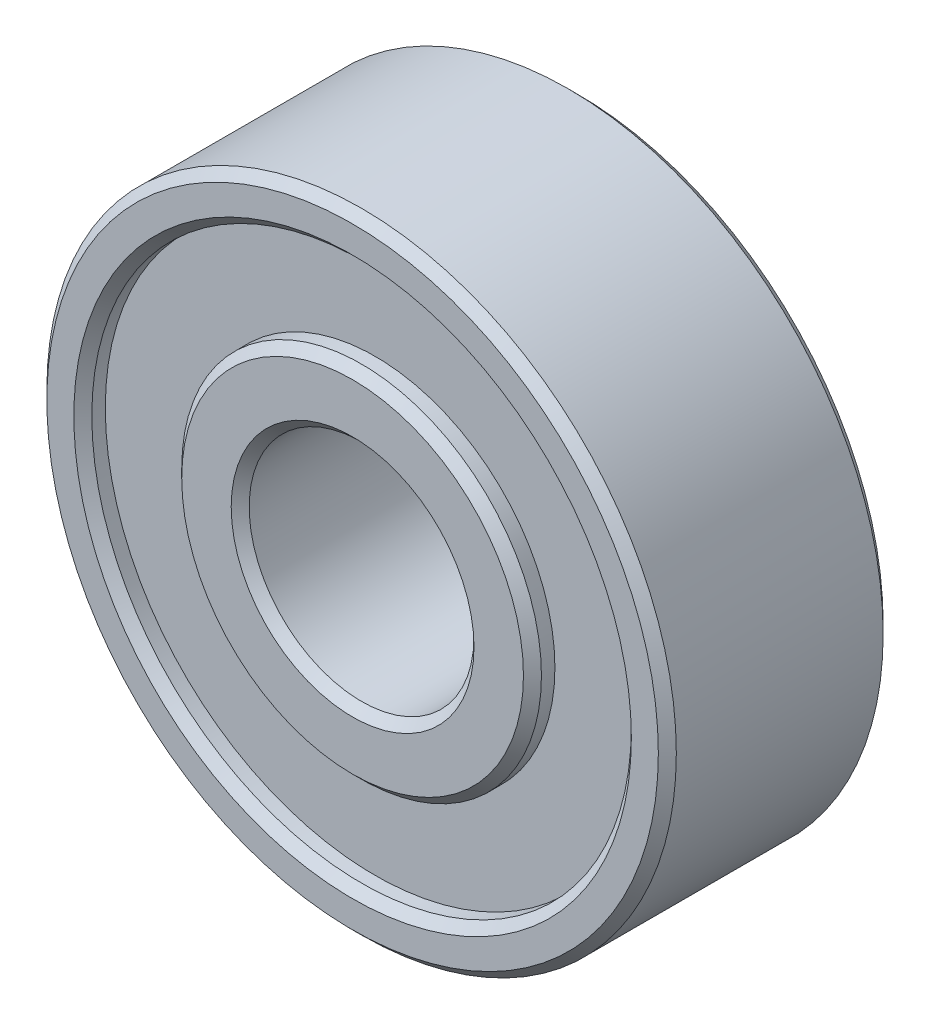
ISO-10303-21;
HEADER;
FILE_DESCRIPTION(('STEP AP214'),'2;1');
FILE_NAME('part.step','',(''),(''),'','','');
FILE_SCHEMA(('AUTOMOTIVE_DESIGN { 1 0 10303 214 1 1 1 1 }'));
ENDSEC;
DATA;
#1=APPLICATION_CONTEXT('core data for automotive mechanical design processes');
#2=APPLICATION_PROTOCOL_DEFINITION('international standard','automotive_design',2000,#1);
#3=PRODUCT_CONTEXT('',#1,'mechanical');
#4=PRODUCT('Part','Part','',(#3));
#5=PRODUCT_RELATED_PRODUCT_CATEGORY('part','',(#4));
#6=PRODUCT_DEFINITION_FORMATION('','',#4);
#7=PRODUCT_DEFINITION_CONTEXT('part definition',#1,'design');
#8=PRODUCT_DEFINITION('design','',#6,#7);
#9=PRODUCT_DEFINITION_SHAPE('','',#8);
#10=(LENGTH_UNIT() NAMED_UNIT(*) SI_UNIT(.MILLI.,.METRE.));
#11=(NAMED_UNIT(*) PLANE_ANGLE_UNIT() SI_UNIT($,.RADIAN.));
#12=(NAMED_UNIT(*) SI_UNIT($,.STERADIAN.) SOLID_ANGLE_UNIT());
#13=UNCERTAINTY_MEASURE_WITH_UNIT(LENGTH_MEASURE(1.E-05),#10,'distance_accuracy_value','');
#14=(GEOMETRIC_REPRESENTATION_CONTEXT(3) GLOBAL_UNCERTAINTY_ASSIGNED_CONTEXT((#13)) GLOBAL_UNIT_ASSIGNED_CONTEXT((#10,
#11,#12)) REPRESENTATION_CONTEXT('',''));
#15=CARTESIAN_POINT('',(0.,0.,0.));
#16=DIRECTION('',(0.,0.,1.));
#17=DIRECTION('',(1.,0.,0.));
#18=AXIS2_PLACEMENT_3D('',#15,#16,#17);
#19=CARTESIAN_POINT('',(0.,0.,0.));
#20=DIRECTION('',(0.,0.,1.));
#21=DIRECTION('',(1.,0.,0.));
#22=AXIS2_PLACEMENT_3D('',#19,#20,#21);
#23=PLANE('',#22);
#24=CARTESIAN_POINT('',(0.,0.,0.));
#25=DIRECTION('',(0.,0.,1.));
#26=DIRECTION('',(1.,0.,0.));
#27=AXIS2_PLACEMENT_3D('',#24,#25,#26);
#28=CIRCLE('',#27,3.8);
#29=CARTESIAN_POINT('',(3.8,0.,0.));
#30=VERTEX_POINT('',#29);
#31=EDGE_CURVE('E73',#30,#30,#28,.F.);
#32=ORIENTED_EDGE('',*,*,#31,.T.);
#33=EDGE_LOOP('',(#32));
#34=FACE_BOUND('',#33,.T.);
#35=CARTESIAN_POINT('',(0.,0.,0.));
#36=DIRECTION('',(0.,0.,1.));
#37=DIRECTION('',(1.,0.,0.));
#38=AXIS2_PLACEMENT_3D('',#35,#36,#37);
#39=CIRCLE('',#38,2.7);
#40=CARTESIAN_POINT('',(2.7,0.,0.));
#41=VERTEX_POINT('',#40);
#42=EDGE_CURVE('E76',#41,#41,#39,.T.);
#43=ORIENTED_EDGE('',*,*,#42,.T.);
#44=EDGE_LOOP('',(#43));
#45=FACE_BOUND('',#44,.T.);
#46=ADVANCED_FACE('F32',(#34,#45),#23,.F.);
#47=CARTESIAN_POINT('',(0.,0.,5.));
#48=DIRECTION('',(0.,0.,1.));
#49=DIRECTION('',(1.,0.,0.));
#50=AXIS2_PLACEMENT_3D('',#47,#48,#49);
#51=PLANE('',#50);
#52=CARTESIAN_POINT('',(0.,0.,5.));
#53=DIRECTION('',(0.,0.,1.));
#54=DIRECTION('',(1.,0.,0.));
#55=AXIS2_PLACEMENT_3D('',#52,#53,#54);
#56=CIRCLE('',#55,3.8);
#57=CARTESIAN_POINT('',(3.8,0.,5.));
#58=VERTEX_POINT('',#57);
#59=EDGE_CURVE('E55',#58,#58,#56,.T.);
#60=ORIENTED_EDGE('',*,*,#59,.T.);
#61=EDGE_LOOP('',(#60));
#62=FACE_BOUND('',#61,.T.);
#63=CARTESIAN_POINT('',(0.,0.,5.));
#64=DIRECTION('',(0.,0.,1.));
#65=DIRECTION('',(1.,0.,0.));
#66=AXIS2_PLACEMENT_3D('',#63,#64,#65);
#67=CIRCLE('',#66,2.7);
#68=CARTESIAN_POINT('',(2.7,0.,5.));
#69=VERTEX_POINT('',#68);
#70=EDGE_CURVE('E58',#69,#69,#67,.F.);
#71=ORIENTED_EDGE('',*,*,#70,.T.);
#72=EDGE_LOOP('',(#71));
#73=FACE_BOUND('',#72,.T.);
#74=ADVANCED_FACE('F121',(#62,#73),#51,.T.);
#75=CARTESIAN_POINT('',(0.,0.,5.));
#76=DIRECTION('',(0.,0.,-1.));
#77=DIRECTION('',(-1.,0.,0.));
#78=AXIS2_PLACEMENT_3D('',#75,#76,#77);
#79=CYLINDRICAL_SURFACE('',#78,7.);
#80=CARTESIAN_POINT('',(0.,0.,0.200000000000001));
#81=DIRECTION('',(0.,0.,1.));
#82=DIRECTION('',(1.,0.,0.));
#83=AXIS2_PLACEMENT_3D('',#80,#81,#82);
#84=CIRCLE('',#83,7.);
#85=CARTESIAN_POINT('',(7.,0.,0.200000000000001));
#86=VERTEX_POINT('',#85);
#87=EDGE_CURVE('E10',#86,#86,#84,.T.);
#88=ORIENTED_EDGE('',*,*,#87,.T.);
#89=EDGE_LOOP('',(#88));
#90=FACE_BOUND('',#89,.T.);
#91=CARTESIAN_POINT('',(0.,0.,4.80000000000001));
#92=DIRECTION('',(0.,0.,1.));
#93=DIRECTION('',(1.,0.,0.));
#94=AXIS2_PLACEMENT_3D('',#91,#92,#93);
#95=CIRCLE('',#94,7.);
#96=CARTESIAN_POINT('',(7.,0.,4.80000000000001));
#97=VERTEX_POINT('',#96);
#98=EDGE_CURVE('E39',#97,#97,#95,.F.);
#99=ORIENTED_EDGE('',*,*,#98,.T.);
#100=EDGE_LOOP('',(#99));
#101=FACE_BOUND('',#100,.T.);
#102=ADVANCED_FACE('F128',(#90,#101),#79,.T.);
#103=CARTESIAN_POINT('',(0.,0.,5.));
#104=DIRECTION('',(0.,0.,1.));
#105=DIRECTION('',(1.,0.,0.));
#106=AXIS2_PLACEMENT_3D('',#103,#104,#105);
#107=CIRCLE('',#106,6.2);
#108=CARTESIAN_POINT('',(6.2,0.,5.));
#109=VERTEX_POINT('',#108);
#110=EDGE_CURVE('E61',#109,#109,#107,.F.);
#111=ORIENTED_EDGE('',*,*,#110,.T.);
#112=EDGE_LOOP('',(#111));
#113=FACE_BOUND('',#112,.T.);
#114=CARTESIAN_POINT('',(0.,0.,5.));
#115=DIRECTION('',(0.,0.,1.));
#116=DIRECTION('',(1.,0.,0.));
#117=AXIS2_PLACEMENT_3D('',#114,#115,#116);
#118=CIRCLE('',#117,6.80000000000001);
#119=CARTESIAN_POINT('',(6.80000000000001,0.,5.));
#120=VERTEX_POINT('',#119);
#121=EDGE_CURVE('E64',#120,#120,#118,.T.);
#122=ORIENTED_EDGE('',*,*,#121,.T.);
#123=EDGE_LOOP('',(#122));
#124=FACE_BOUND('',#123,.T.);
#125=ADVANCED_FACE('F131',(#113,#124),#51,.T.);
#126=CARTESIAN_POINT('',(0.,0.,0.));
#127=DIRECTION('',(0.,0.,1.));
#128=DIRECTION('',(1.,0.,0.));
#129=AXIS2_PLACEMENT_3D('',#126,#127,#128);
#130=CIRCLE('',#129,6.2);
#131=CARTESIAN_POINT('',(6.2,0.,0.));
#132=VERTEX_POINT('',#131);
#133=EDGE_CURVE('E79',#132,#132,#130,.T.);
#134=ORIENTED_EDGE('',*,*,#133,.T.);
#135=EDGE_LOOP('',(#134));
#136=FACE_BOUND('',#135,.T.);
#137=CARTESIAN_POINT('',(0.,0.,0.));
#138=DIRECTION('',(0.,0.,1.));
#139=DIRECTION('',(1.,0.,0.));
#140=AXIS2_PLACEMENT_3D('',#137,#138,#139);
#141=CIRCLE('',#140,6.8);
#142=CARTESIAN_POINT('',(6.8,0.,0.));
#143=VERTEX_POINT('',#142);
#144=EDGE_CURVE('E82',#143,#143,#141,.F.);
#145=ORIENTED_EDGE('',*,*,#144,.T.);
#146=EDGE_LOOP('',(#145));
#147=FACE_BOUND('',#146,.T.);
#148=ADVANCED_FACE('F124',(#136,#147),#23,.F.);
#149=CARTESIAN_POINT('',(0.,0.,0.));
#150=DIRECTION('',(0.,0.,1.));
#151=DIRECTION('',(1.,0.,0.));
#152=AXIS2_PLACEMENT_3D('',#149,#150,#151);
#153=CYLINDRICAL_SURFACE('',#152,2.5);
#154=CARTESIAN_POINT('',(0.,0.,4.8));
#155=DIRECTION('',(0.,0.,1.));
#156=DIRECTION('',(1.,0.,0.));
#157=AXIS2_PLACEMENT_3D('',#154,#155,#156);
#158=CIRCLE('',#157,2.5);
#159=CARTESIAN_POINT('',(2.5,0.,4.8));
#160=VERTEX_POINT('',#159);
#161=EDGE_CURVE('E43',#160,#160,#158,.T.);
#162=ORIENTED_EDGE('',*,*,#161,.T.);
#163=EDGE_LOOP('',(#162));
#164=FACE_BOUND('',#163,.T.);
#165=CARTESIAN_POINT('',(0.,0.,0.2));
#166=DIRECTION('',(0.,0.,1.));
#167=DIRECTION('',(1.,0.,0.));
#168=AXIS2_PLACEMENT_3D('',#165,#166,#167);
#169=CIRCLE('',#168,2.5);
#170=CARTESIAN_POINT('',(2.5,0.,0.2));
#171=VERTEX_POINT('',#170);
#172=EDGE_CURVE('E47',#171,#171,#169,.F.);
#173=ORIENTED_EDGE('',*,*,#172,.T.);
#174=EDGE_LOOP('',(#173));
#175=FACE_BOUND('',#174,.T.);
#176=ADVANCED_FACE('F135',(#164,#175),#153,.F.);
#177=CARTESIAN_POINT('',(0.,0.,4.5));
#178=DIRECTION('',(0.,0.,1.));
#179=DIRECTION('',(1.,0.,0.));
#180=AXIS2_PLACEMENT_3D('',#177,#178,#179);
#181=CYLINDRICAL_SURFACE('',#180,6.);
#182=CARTESIAN_POINT('',(0.,0.,4.80000000000001));
#183=DIRECTION('',(0.,0.,1.));
#184=DIRECTION('',(1.,0.,0.));
#185=AXIS2_PLACEMENT_3D('',#182,#183,#184);
#186=CIRCLE('',#185,6.);
#187=CARTESIAN_POINT('',(6.,0.,4.80000000000001));
#188=VERTEX_POINT('',#187);
#189=EDGE_CURVE('E67',#188,#188,#186,.T.);
#190=ORIENTED_EDGE('',*,*,#189,.T.);
#191=EDGE_LOOP('',(#190));
#192=FACE_BOUND('',#191,.T.);
#193=CARTESIAN_POINT('',(0.,0.,4.5));
#194=DIRECTION('',(0.,0.,1.));
#195=DIRECTION('',(1.,0.,0.));
#196=AXIS2_PLACEMENT_3D('',#193,#194,#195);
#197=CIRCLE('',#196,6.);
#198=CARTESIAN_POINT('',(6.,0.,4.5));
#199=VERTEX_POINT('',#198);
#200=EDGE_CURVE('E88',#199,#199,#197,.T.);
#201=ORIENTED_EDGE('',*,*,#200,.F.);
#202=EDGE_LOOP('',(#201));
#203=FACE_BOUND('',#202,.T.);
#204=ADVANCED_FACE('F141',(#192,#203),#181,.F.);
#205=CARTESIAN_POINT('',(0.,0.,4.5));
#206=DIRECTION('',(0.,0.,1.));
#207=DIRECTION('',(1.,0.,0.));
#208=AXIS2_PLACEMENT_3D('',#205,#206,#207);
#209=PLANE('',#208);
#210=CARTESIAN_POINT('',(0.,0.,4.5));
#211=DIRECTION('',(0.,0.,1.));
#212=DIRECTION('',(1.,0.,0.));
#213=AXIS2_PLACEMENT_3D('',#210,#211,#212);
#214=CIRCLE('',#213,4.);
#215=CARTESIAN_POINT('',(4.,0.,4.5));
#216=VERTEX_POINT('',#215);
#217=EDGE_CURVE('E91',#216,#216,#214,.T.);
#218=ORIENTED_EDGE('',*,*,#217,.F.);
#219=EDGE_LOOP('',(#218));
#220=FACE_BOUND('',#219,.T.);
#221=ORIENTED_EDGE('',*,*,#200,.T.);
#222=EDGE_LOOP('',(#221));
#223=FACE_BOUND('',#222,.T.);
#224=ADVANCED_FACE('F117',(#220,#223),#209,.T.);
#225=CARTESIAN_POINT('',(0.,0.,4.5));
#226=DIRECTION('',(0.,0.,1.));
#227=DIRECTION('',(1.,0.,0.));
#228=AXIS2_PLACEMENT_3D('',#225,#226,#227);
#229=CYLINDRICAL_SURFACE('',#228,4.);
#230=CARTESIAN_POINT('',(0.,0.,4.8));
#231=DIRECTION('',(0.,0.,1.));
#232=DIRECTION('',(1.,0.,0.));
#233=AXIS2_PLACEMENT_3D('',#230,#231,#232);
#234=CIRCLE('',#233,4.);
#235=CARTESIAN_POINT('',(4.,0.,4.8));
#236=VERTEX_POINT('',#235);
#237=EDGE_CURVE('E52',#236,#236,#234,.F.);
#238=ORIENTED_EDGE('',*,*,#237,.T.);
#239=EDGE_LOOP('',(#238));
#240=FACE_BOUND('',#239,.T.);
#241=ORIENTED_EDGE('',*,*,#217,.T.);
#242=EDGE_LOOP('',(#241));
#243=FACE_BOUND('',#242,.T.);
#244=ADVANCED_FACE('F111',(#240,#243),#229,.T.);
#245=CARTESIAN_POINT('',(0.,0.,0.5));
#246=DIRECTION('',(0.,0.,-1.));
#247=DIRECTION('',(-1.,0.,0.));
#248=AXIS2_PLACEMENT_3D('',#245,#246,#247);
#249=CYLINDRICAL_SURFACE('',#248,6.);
#250=CARTESIAN_POINT('',(0.,0.,0.200000000000002));
#251=DIRECTION('',(0.,0.,1.));
#252=DIRECTION('',(1.,0.,0.));
#253=AXIS2_PLACEMENT_3D('',#250,#251,#252);
#254=CIRCLE('',#253,6.);
#255=CARTESIAN_POINT('',(6.,0.,0.200000000000002));
#256=VERTEX_POINT('',#255);
#257=EDGE_CURVE('E85',#256,#256,#254,.F.);
#258=ORIENTED_EDGE('',*,*,#257,.T.);
#259=EDGE_LOOP('',(#258));
#260=FACE_BOUND('',#259,.T.);
#261=CARTESIAN_POINT('',(0.,0.,0.5));
#262=DIRECTION('',(0.,0.,-1.));
#263=DIRECTION('',(-1.,0.,0.));
#264=AXIS2_PLACEMENT_3D('',#261,#262,#263);
#265=CIRCLE('',#264,6.);
#266=CARTESIAN_POINT('',(-6.,0.,0.5));
#267=VERTEX_POINT('',#266);
#268=EDGE_CURVE('E94',#267,#267,#265,.T.);
#269=ORIENTED_EDGE('',*,*,#268,.F.);
#270=EDGE_LOOP('',(#269));
#271=FACE_BOUND('',#270,.T.);
#272=ADVANCED_FACE('F106',(#260,#271),#249,.F.);
#273=CARTESIAN_POINT('',(0.,0.,0.5));
#274=DIRECTION('',(0.,0.,-1.));
#275=DIRECTION('',(-1.,0.,0.));
#276=AXIS2_PLACEMENT_3D('',#273,#274,#275);
#277=PLANE('',#276);
#278=CARTESIAN_POINT('',(0.,0.,0.5));
#279=DIRECTION('',(0.,0.,-1.));
#280=DIRECTION('',(-1.,0.,0.));
#281=AXIS2_PLACEMENT_3D('',#278,#279,#280);
#282=CIRCLE('',#281,4.);
#283=CARTESIAN_POINT('',(-4.,0.,0.5));
#284=VERTEX_POINT('',#283);
#285=EDGE_CURVE('E97',#284,#284,#282,.T.);
#286=ORIENTED_EDGE('',*,*,#285,.F.);
#287=EDGE_LOOP('',(#286));
#288=FACE_BOUND('',#287,.T.);
#289=ORIENTED_EDGE('',*,*,#268,.T.);
#290=EDGE_LOOP('',(#289));
#291=FACE_BOUND('',#290,.T.);
#292=ADVANCED_FACE('F103',(#288,#291),#277,.T.);
#293=CARTESIAN_POINT('',(0.,0.,0.5));
#294=DIRECTION('',(0.,0.,-1.));
#295=DIRECTION('',(-1.,0.,0.));
#296=AXIS2_PLACEMENT_3D('',#293,#294,#295);
#297=CYLINDRICAL_SURFACE('',#296,4.);
#298=CARTESIAN_POINT('',(0.,0.,0.199999999999999));
#299=DIRECTION('',(0.,0.,1.));
#300=DIRECTION('',(1.,0.,0.));
#301=AXIS2_PLACEMENT_3D('',#298,#299,#300);
#302=CIRCLE('',#301,4.);
#303=CARTESIAN_POINT('',(4.,0.,0.199999999999999));
#304=VERTEX_POINT('',#303);
#305=EDGE_CURVE('E70',#304,#304,#302,.T.);
#306=ORIENTED_EDGE('',*,*,#305,.T.);
#307=EDGE_LOOP('',(#306));
#308=FACE_BOUND('',#307,.T.);
#309=ORIENTED_EDGE('',*,*,#285,.T.);
#310=EDGE_LOOP('',(#309));
#311=FACE_BOUND('',#310,.T.);
#312=ADVANCED_FACE('F101',(#308,#311),#297,.T.);
#313=CARTESIAN_POINT('',(0.,0.,0.200000000000002));
#314=DIRECTION('',(0.,0.,-1.));
#315=DIRECTION('',(-1.,0.,0.));
#316=AXIS2_PLACEMENT_3D('',#313,#314,#315);
#317=CONICAL_SURFACE('',#316,6.,0.785398163397448);
#318=ORIENTED_EDGE('',*,*,#133,.F.);
#319=EDGE_LOOP('',(#318));
#320=FACE_BOUND('',#319,.T.);
#321=ORIENTED_EDGE('',*,*,#257,.F.);
#322=EDGE_LOOP('',(#321));
#323=FACE_BOUND('',#322,.T.);
#324=ADVANCED_FACE('F176',(#320,#323),#317,.F.);
#325=CARTESIAN_POINT('',(0.,0.,0.));
#326=DIRECTION('',(0.,0.,1.));
#327=DIRECTION('',(1.,0.,0.));
#328=AXIS2_PLACEMENT_3D('',#325,#326,#327);
#329=CONICAL_SURFACE('',#328,3.8,0.785398163397453);
#330=ORIENTED_EDGE('',*,*,#305,.F.);
#331=EDGE_LOOP('',(#330));
#332=FACE_BOUND('',#331,.T.);
#333=ORIENTED_EDGE('',*,*,#31,.F.);
#334=EDGE_LOOP('',(#333));
#335=FACE_BOUND('',#334,.T.);
#336=ADVANCED_FACE('F172',(#332,#335),#329,.T.);
#337=CARTESIAN_POINT('',(0.,0.,4.80000000000001));
#338=DIRECTION('',(0.,0.,1.));
#339=DIRECTION('',(1.,0.,0.));
#340=AXIS2_PLACEMENT_3D('',#337,#338,#339);
#341=CONICAL_SURFACE('',#340,6.,0.785398163397453);
#342=ORIENTED_EDGE('',*,*,#110,.F.);
#343=EDGE_LOOP('',(#342));
#344=FACE_BOUND('',#343,.T.);
#345=ORIENTED_EDGE('',*,*,#189,.F.);
#346=EDGE_LOOP('',(#345));
#347=FACE_BOUND('',#346,.T.);
#348=ADVANCED_FACE('F168',(#344,#347),#341,.F.);
#349=CARTESIAN_POINT('',(0.,0.,5.));
#350=DIRECTION('',(0.,0.,-1.));
#351=DIRECTION('',(-1.,0.,0.));
#352=AXIS2_PLACEMENT_3D('',#349,#350,#351);
#353=CONICAL_SURFACE('',#352,3.8,0.785398163397453);
#354=ORIENTED_EDGE('',*,*,#237,.F.);
#355=EDGE_LOOP('',(#354));
#356=FACE_BOUND('',#355,.T.);
#357=ORIENTED_EDGE('',*,*,#59,.F.);
#358=EDGE_LOOP('',(#357));
#359=FACE_BOUND('',#358,.T.);
#360=ADVANCED_FACE('F164',(#356,#359),#353,.T.);
#361=CARTESIAN_POINT('',(0.,0.,4.8));
#362=DIRECTION('',(0.,0.,1.));
#363=DIRECTION('',(1.,0.,0.));
#364=AXIS2_PLACEMENT_3D('',#361,#362,#363);
#365=CONICAL_SURFACE('',#364,2.5,0.785398163397449);
#366=ORIENTED_EDGE('',*,*,#70,.F.);
#367=EDGE_LOOP('',(#366));
#368=FACE_BOUND('',#367,.T.);
#369=ORIENTED_EDGE('',*,*,#161,.F.);
#370=EDGE_LOOP('',(#369));
#371=FACE_BOUND('',#370,.T.);
#372=ADVANCED_FACE('F158',(#368,#371),#365,.F.);
#373=CARTESIAN_POINT('',(0.,0.,0.));
#374=DIRECTION('',(0.,0.,-1.));
#375=DIRECTION('',(-1.,0.,0.));
#376=AXIS2_PLACEMENT_3D('',#373,#374,#375);
#377=CONICAL_SURFACE('',#376,2.7,0.785398163397447);
#378=ORIENTED_EDGE('',*,*,#172,.F.);
#379=EDGE_LOOP('',(#378));
#380=FACE_BOUND('',#379,.T.);
#381=ORIENTED_EDGE('',*,*,#42,.F.);
#382=EDGE_LOOP('',(#381));
#383=FACE_BOUND('',#382,.T.);
#384=ADVANCED_FACE('F152',(#380,#383),#377,.F.);
#385=CARTESIAN_POINT('',(0.,0.,0.200000000000001));
#386=DIRECTION('',(0.,0.,1.));
#387=DIRECTION('',(1.,0.,0.));
#388=AXIS2_PLACEMENT_3D('',#385,#386,#387);
#389=CONICAL_SURFACE('',#388,7.,0.78539816339745);
#390=ORIENTED_EDGE('',*,*,#144,.F.);
#391=EDGE_LOOP('',(#390));
#392=FACE_BOUND('',#391,.T.);
#393=ORIENTED_EDGE('',*,*,#87,.F.);
#394=EDGE_LOOP('',(#393));
#395=FACE_BOUND('',#394,.T.);
#396=ADVANCED_FACE('F149',(#392,#395),#389,.T.);
#397=CARTESIAN_POINT('',(0.,0.,5.));
#398=DIRECTION('',(0.,0.,-1.));
#399=DIRECTION('',(-1.,0.,0.));
#400=AXIS2_PLACEMENT_3D('',#397,#398,#399);
#401=CONICAL_SURFACE('',#400,6.80000000000001,0.785398163397446);
#402=ORIENTED_EDGE('',*,*,#98,.F.);
#403=EDGE_LOOP('',(#402));
#404=FACE_BOUND('',#403,.T.);
#405=ORIENTED_EDGE('',*,*,#121,.F.);
#406=EDGE_LOOP('',(#405));
#407=FACE_BOUND('',#406,.T.);
#408=ADVANCED_FACE('F34',(#404,#407),#401,.T.);
#409=CLOSED_SHELL('',(#46,#74,#102,#125,#148,#176,#204,#224,#244,#272,#292,#312,#324,#336,#348,
#360,#372,#384,#396,#408));
#410=MANIFOLD_SOLID_BREP('B2',#409);
#411=ADVANCED_BREP_SHAPE_REPRESENTATION('',(#18,#410),#14);
#412=SHAPE_DEFINITION_REPRESENTATION(#9,#411);
ENDSEC;
END-ISO-10303-21;
